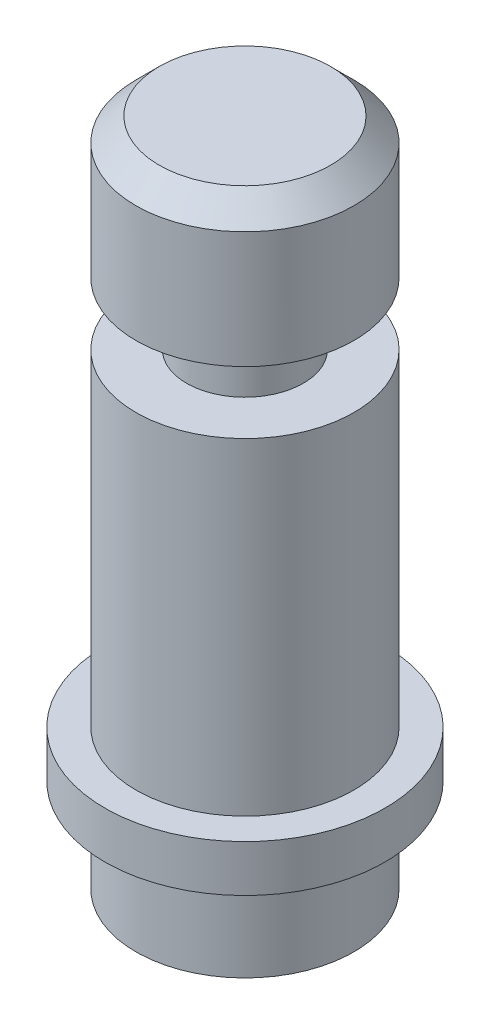
ISO-10303-21;
HEADER;
FILE_DESCRIPTION(('STEP AP214'),'2;1');
FILE_NAME('part.step','',(''),(''),'','','');
FILE_SCHEMA(('AUTOMOTIVE_DESIGN { 1 0 10303 214 1 1 1 1 }'));
ENDSEC;
DATA;
#1=APPLICATION_CONTEXT('core data for automotive mechanical design processes');
#2=APPLICATION_PROTOCOL_DEFINITION('international standard','automotive_design',2000,#1);
#3=PRODUCT_CONTEXT('',#1,'mechanical');
#4=PRODUCT('Part','Part','',(#3));
#5=PRODUCT_RELATED_PRODUCT_CATEGORY('part','',(#4));
#6=PRODUCT_DEFINITION_FORMATION('','',#4);
#7=PRODUCT_DEFINITION_CONTEXT('part definition',#1,'design');
#8=PRODUCT_DEFINITION('design','',#6,#7);
#9=PRODUCT_DEFINITION_SHAPE('','',#8);
#10=(LENGTH_UNIT() NAMED_UNIT(*) SI_UNIT(.MILLI.,.METRE.));
#11=(NAMED_UNIT(*) PLANE_ANGLE_UNIT() SI_UNIT($,.RADIAN.));
#12=(NAMED_UNIT(*) SI_UNIT($,.STERADIAN.) SOLID_ANGLE_UNIT());
#13=UNCERTAINTY_MEASURE_WITH_UNIT(LENGTH_MEASURE(1.E-05),#10,'distance_accuracy_value','');
#14=(GEOMETRIC_REPRESENTATION_CONTEXT(3) GLOBAL_UNCERTAINTY_ASSIGNED_CONTEXT((#13)) GLOBAL_UNIT_ASSIGNED_CONTEXT((#10,
#11,#12)) REPRESENTATION_CONTEXT('',''));
#15=CARTESIAN_POINT('',(0.,0.,0.));
#16=DIRECTION('',(0.,0.,1.));
#17=DIRECTION('',(1.,0.,0.));
#18=AXIS2_PLACEMENT_3D('',#15,#16,#17);
#19=CARTESIAN_POINT('',(7.,0.,0.));
#20=DIRECTION('',(0.,-1.,0.));
#21=DIRECTION('',(1.,0.,0.));
#22=AXIS2_PLACEMENT_3D('',#19,#20,#21);
#23=PLANE('',#22);
#24=CARTESIAN_POINT('',(7.,0.,0.));
#25=DIRECTION('',(0.,1.,0.));
#26=DIRECTION('',(-1.,0.,0.));
#27=AXIS2_PLACEMENT_3D('',#24,#25,#26);
#28=CIRCLE('',#27,7.);
#29=CARTESIAN_POINT('',(0.,0.,0.));
#30=VERTEX_POINT('',#29);
#31=EDGE_CURVE('E55',#30,#30,#28,.T.);
#32=ORIENTED_EDGE('',*,*,#31,.F.);
#33=EDGE_LOOP('',(#32));
#34=FACE_BOUND('',#33,.T.);
#35=ADVANCED_FACE('F43',(#34),#23,.T.);
#36=CARTESIAN_POINT('',(6.99999999999999,43.,0.));
#37=DIRECTION('',(0.,1.,0.));
#38=DIRECTION('',(-1.,0.,0.));
#39=AXIS2_PLACEMENT_3D('',#36,#37,#38);
#40=CYLINDRICAL_SURFACE('',#39,7.);
#41=ORIENTED_EDGE('',*,*,#31,.T.);
#42=EDGE_LOOP('',(#41));
#43=FACE_BOUND('',#42,.T.);
#44=CARTESIAN_POINT('',(7.,5.99999999999998,0.));
#45=DIRECTION('',(0.,1.,0.));
#46=DIRECTION('',(-1.,0.,0.));
#47=AXIS2_PLACEMENT_3D('',#44,#45,#46);
#48=CIRCLE('',#47,7.);
#49=CARTESIAN_POINT('',(0.,5.99999999999998,0.));
#50=VERTEX_POINT('',#49);
#51=EDGE_CURVE('E59',#50,#50,#48,.T.);
#52=ORIENTED_EDGE('',*,*,#51,.F.);
#53=EDGE_LOOP('',(#52));
#54=FACE_BOUND('',#53,.T.);
#55=ADVANCED_FACE('F103',(#43,#54),#40,.T.);
#56=CARTESIAN_POINT('',(0.,5.99999999999999,0.));
#57=DIRECTION('',(0.,-1.,0.));
#58=DIRECTION('',(1.,0.,0.));
#59=AXIS2_PLACEMENT_3D('',#56,#57,#58);
#60=PLANE('',#59);
#61=ORIENTED_EDGE('',*,*,#51,.T.);
#62=EDGE_LOOP('',(#61));
#63=FACE_BOUND('',#62,.T.);
#64=CARTESIAN_POINT('',(7.,5.99999999999998,0.));
#65=DIRECTION('',(0.,1.,0.));
#66=DIRECTION('',(-1.,0.,0.));
#67=AXIS2_PLACEMENT_3D('',#64,#65,#66);
#68=CIRCLE('',#67,9.);
#69=CARTESIAN_POINT('',(-2.,5.99999999999998,0.));
#70=VERTEX_POINT('',#69);
#71=EDGE_CURVE('E64',#70,#70,#68,.T.);
#72=ORIENTED_EDGE('',*,*,#71,.F.);
#73=EDGE_LOOP('',(#72));
#74=FACE_BOUND('',#73,.T.);
#75=ADVANCED_FACE('F108',(#63,#74),#60,.T.);
#76=CARTESIAN_POINT('',(6.99999999999999,43.,0.));
#77=DIRECTION('',(0.,1.,0.));
#78=DIRECTION('',(-1.,0.,0.));
#79=AXIS2_PLACEMENT_3D('',#76,#77,#78);
#80=CYLINDRICAL_SURFACE('',#79,9.);
#81=ORIENTED_EDGE('',*,*,#71,.T.);
#82=EDGE_LOOP('',(#81));
#83=FACE_BOUND('',#82,.T.);
#84=CARTESIAN_POINT('',(7.,8.99999999999999,0.));
#85=DIRECTION('',(0.,1.,0.));
#86=DIRECTION('',(-1.,0.,0.));
#87=AXIS2_PLACEMENT_3D('',#84,#85,#86);
#88=CIRCLE('',#87,9.);
#89=CARTESIAN_POINT('',(-2.,8.99999999999999,0.));
#90=VERTEX_POINT('',#89);
#91=EDGE_CURVE('E67',#90,#90,#88,.T.);
#92=ORIENTED_EDGE('',*,*,#91,.F.);
#93=EDGE_LOOP('',(#92));
#94=FACE_BOUND('',#93,.T.);
#95=ADVANCED_FACE('F115',(#83,#94),#80,.T.);
#96=CARTESIAN_POINT('',(-2.,8.99999999999999,0.));
#97=DIRECTION('',(0.,1.,0.));
#98=DIRECTION('',(-1.,0.,0.));
#99=AXIS2_PLACEMENT_3D('',#96,#97,#98);
#100=PLANE('',#99);
#101=ORIENTED_EDGE('',*,*,#91,.T.);
#102=EDGE_LOOP('',(#101));
#103=FACE_BOUND('',#102,.T.);
#104=CARTESIAN_POINT('',(7.,8.99999999999999,0.));
#105=DIRECTION('',(0.,1.,0.));
#106=DIRECTION('',(-1.,0.,0.));
#107=AXIS2_PLACEMENT_3D('',#104,#105,#106);
#108=CIRCLE('',#107,7.);
#109=CARTESIAN_POINT('',(0.,8.99999999999999,0.));
#110=VERTEX_POINT('',#109);
#111=EDGE_CURVE('E70',#110,#110,#108,.T.);
#112=ORIENTED_EDGE('',*,*,#111,.F.);
#113=EDGE_LOOP('',(#112));
#114=FACE_BOUND('',#113,.T.);
#115=ADVANCED_FACE('F119',(#103,#114),#100,.T.);
#116=CARTESIAN_POINT('',(6.99999999999999,43.,0.));
#117=DIRECTION('',(0.,1.,0.));
#118=DIRECTION('',(-1.,0.,0.));
#119=AXIS2_PLACEMENT_3D('',#116,#117,#118);
#120=CYLINDRICAL_SURFACE('',#119,7.);
#121=ORIENTED_EDGE('',*,*,#111,.T.);
#122=EDGE_LOOP('',(#121));
#123=FACE_BOUND('',#122,.T.);
#124=CARTESIAN_POINT('',(7.,30.,0.));
#125=DIRECTION('',(0.,1.,0.));
#126=DIRECTION('',(-1.,0.,0.));
#127=AXIS2_PLACEMENT_3D('',#124,#125,#126);
#128=CIRCLE('',#127,7.);
#129=CARTESIAN_POINT('',(0.,30.,0.));
#130=VERTEX_POINT('',#129);
#131=EDGE_CURVE('E73',#130,#130,#128,.T.);
#132=ORIENTED_EDGE('',*,*,#131,.F.);
#133=EDGE_LOOP('',(#132));
#134=FACE_BOUND('',#133,.T.);
#135=ADVANCED_FACE('F123',(#123,#134),#120,.T.);
#136=CARTESIAN_POINT('',(0.,30.,0.));
#137=DIRECTION('',(0.,1.,0.));
#138=DIRECTION('',(-1.,0.,0.));
#139=AXIS2_PLACEMENT_3D('',#136,#137,#138);
#140=PLANE('',#139);
#141=ORIENTED_EDGE('',*,*,#131,.T.);
#142=EDGE_LOOP('',(#141));
#143=FACE_BOUND('',#142,.T.);
#144=CARTESIAN_POINT('',(7.,30.,0.));
#145=DIRECTION('',(0.,1.,0.));
#146=DIRECTION('',(-1.,0.,0.));
#147=AXIS2_PLACEMENT_3D('',#144,#145,#146);
#148=CIRCLE('',#147,3.75);
#149=CARTESIAN_POINT('',(3.25,30.,0.));
#150=VERTEX_POINT('',#149);
#151=EDGE_CURVE('E76',#150,#150,#148,.T.);
#152=ORIENTED_EDGE('',*,*,#151,.F.);
#153=EDGE_LOOP('',(#152));
#154=FACE_BOUND('',#153,.T.);
#155=ADVANCED_FACE('F99',(#143,#154),#140,.T.);
#156=CARTESIAN_POINT('',(6.99999999999999,43.,0.));
#157=DIRECTION('',(0.,1.,0.));
#158=DIRECTION('',(-1.,0.,0.));
#159=AXIS2_PLACEMENT_3D('',#156,#157,#158);
#160=CYLINDRICAL_SURFACE('',#159,3.75);
#161=ORIENTED_EDGE('',*,*,#151,.T.);
#162=EDGE_LOOP('',(#161));
#163=FACE_BOUND('',#162,.T.);
#164=CARTESIAN_POINT('',(7.,34.,0.));
#165=DIRECTION('',(0.,1.,0.));
#166=DIRECTION('',(-1.,0.,0.));
#167=AXIS2_PLACEMENT_3D('',#164,#165,#166);
#168=CIRCLE('',#167,3.75);
#169=CARTESIAN_POINT('',(3.25,34.,0.));
#170=VERTEX_POINT('',#169);
#171=EDGE_CURVE('E79',#170,#170,#168,.T.);
#172=ORIENTED_EDGE('',*,*,#171,.F.);
#173=EDGE_LOOP('',(#172));
#174=FACE_BOUND('',#173,.T.);
#175=ADVANCED_FACE('F90',(#163,#174),#160,.T.);
#176=CARTESIAN_POINT('',(3.25,34.,0.));
#177=DIRECTION('',(0.,-1.,0.));
#178=DIRECTION('',(1.,0.,0.));
#179=AXIS2_PLACEMENT_3D('',#176,#177,#178);
#180=PLANE('',#179);
#181=ORIENTED_EDGE('',*,*,#171,.T.);
#182=EDGE_LOOP('',(#181));
#183=FACE_BOUND('',#182,.T.);
#184=CARTESIAN_POINT('',(7.,34.,0.));
#185=DIRECTION('',(0.,1.,0.));
#186=DIRECTION('',(-1.,0.,0.));
#187=AXIS2_PLACEMENT_3D('',#184,#185,#186);
#188=CIRCLE('',#187,7.);
#189=CARTESIAN_POINT('',(0.,34.,0.));
#190=VERTEX_POINT('',#189);
#191=EDGE_CURVE('E82',#190,#190,#188,.T.);
#192=ORIENTED_EDGE('',*,*,#191,.F.);
#193=EDGE_LOOP('',(#192));
#194=FACE_BOUND('',#193,.T.);
#195=ADVANCED_FACE('F88',(#183,#194),#180,.T.);
#196=CARTESIAN_POINT('',(6.99999999999999,43.,0.));
#197=DIRECTION('',(0.,1.,0.));
#198=DIRECTION('',(-1.,0.,0.));
#199=AXIS2_PLACEMENT_3D('',#196,#197,#198);
#200=CYLINDRICAL_SURFACE('',#199,7.);
#201=CARTESIAN_POINT('',(6.99999999999999,41.5,0.));
#202=DIRECTION('',(0.,1.,0.));
#203=DIRECTION('',(0.,0.,1.));
#204=AXIS2_PLACEMENT_3D('',#201,#202,#203);
#205=CIRCLE('',#204,7.);
#206=CARTESIAN_POINT('',(6.99999999999999,41.5,7.));
#207=VERTEX_POINT('',#206);
#208=EDGE_CURVE('E10',#207,#207,#205,.F.);
#209=ORIENTED_EDGE('',*,*,#208,.T.);
#210=EDGE_LOOP('',(#209));
#211=FACE_BOUND('',#210,.T.);
#212=ORIENTED_EDGE('',*,*,#191,.T.);
#213=EDGE_LOOP('',(#212));
#214=FACE_BOUND('',#213,.T.);
#215=ADVANCED_FACE('F86',(#211,#214),#200,.T.);
#216=CARTESIAN_POINT('',(0.,43.,0.));
#217=DIRECTION('',(0.,1.,0.));
#218=DIRECTION('',(-1.,0.,0.));
#219=AXIS2_PLACEMENT_3D('',#216,#217,#218);
#220=PLANE('',#219);
#221=CARTESIAN_POINT('',(6.99999999999999,43.,0.));
#222=DIRECTION('',(0.,1.,0.));
#223=DIRECTION('',(-1.,0.,0.));
#224=AXIS2_PLACEMENT_3D('',#221,#222,#223);
#225=CIRCLE('',#224,5.50000000000001);
#226=CARTESIAN_POINT('',(1.49999999999999,43.,0.));
#227=VERTEX_POINT('',#226);
#228=EDGE_CURVE('E51',#227,#227,#225,.T.);
#229=ORIENTED_EDGE('',*,*,#228,.T.);
#230=EDGE_LOOP('',(#229));
#231=FACE_BOUND('',#230,.T.);
#232=ADVANCED_FACE('F97',(#231),#220,.T.);
#233=CARTESIAN_POINT('',(6.99999999999999,43.,0.));
#234=DIRECTION('',(0.,-1.,0.));
#235=DIRECTION('',(0.,0.,-1.));
#236=AXIS2_PLACEMENT_3D('',#233,#234,#235);
#237=CONICAL_SURFACE('',#236,5.50000000000001,0.785398163397447);
#238=ORIENTED_EDGE('',*,*,#208,.F.);
#239=EDGE_LOOP('',(#238));
#240=FACE_BOUND('',#239,.T.);
#241=ORIENTED_EDGE('',*,*,#228,.F.);
#242=EDGE_LOOP('',(#241));
#243=FACE_BOUND('',#242,.T.);
#244=ADVANCED_FACE('F46',(#240,#243),#237,.T.);
#245=CLOSED_SHELL('',(#35,#55,#75,#95,#115,#135,#155,#175,#195,#215,#232,#244));
#246=MANIFOLD_SOLID_BREP('B2',#245);
#247=ADVANCED_BREP_SHAPE_REPRESENTATION('',(#18,#246),#14);
#248=SHAPE_DEFINITION_REPRESENTATION(#9,#247);
ENDSEC;
END-ISO-10303-21;
